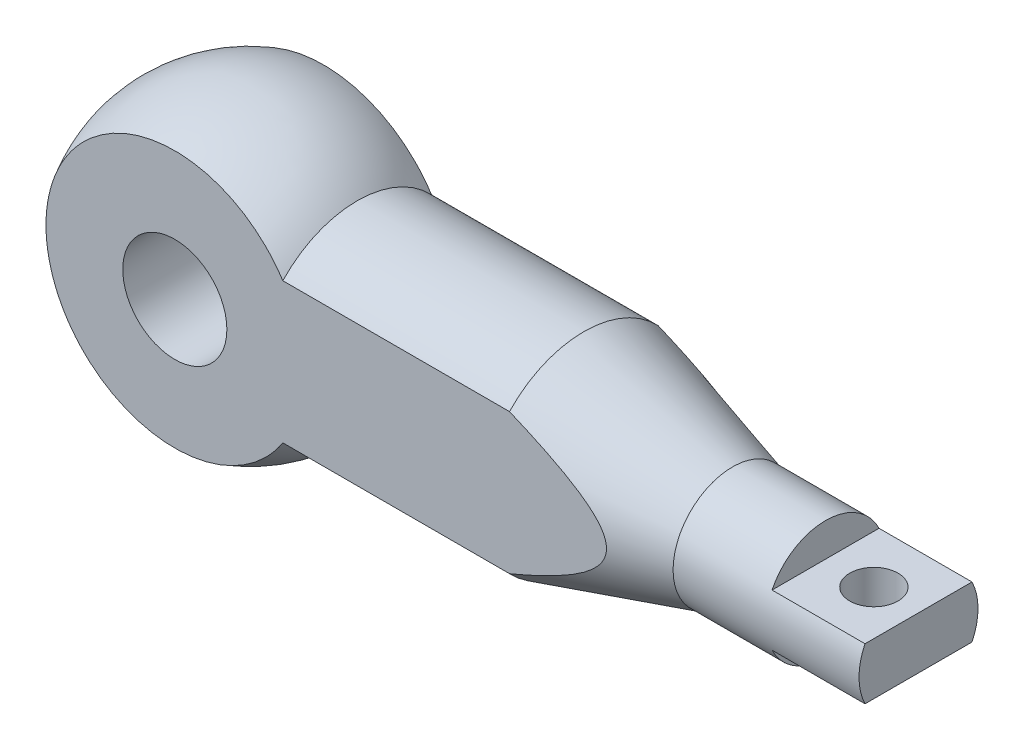
ISO-10303-21;
HEADER;
FILE_DESCRIPTION(('STEP AP214'),'2;1');
FILE_NAME('part.step','',(''),(''),'','','');
FILE_SCHEMA(('AUTOMOTIVE_DESIGN { 1 0 10303 214 1 1 1 1 }'));
ENDSEC;
DATA;
#1=APPLICATION_CONTEXT('core data for automotive mechanical design processes');
#2=APPLICATION_PROTOCOL_DEFINITION('international standard','automotive_design',2000,#1);
#3=PRODUCT_CONTEXT('',#1,'mechanical');
#4=PRODUCT('Part','Part','',(#3));
#5=PRODUCT_RELATED_PRODUCT_CATEGORY('part','',(#4));
#6=PRODUCT_DEFINITION_FORMATION('','',#4);
#7=PRODUCT_DEFINITION_CONTEXT('part definition',#1,'design');
#8=PRODUCT_DEFINITION('design','',#6,#7);
#9=PRODUCT_DEFINITION_SHAPE('','',#8);
#10=(LENGTH_UNIT() NAMED_UNIT(*) SI_UNIT(.MILLI.,.METRE.));
#11=(NAMED_UNIT(*) PLANE_ANGLE_UNIT() SI_UNIT($,.RADIAN.));
#12=(NAMED_UNIT(*) SI_UNIT($,.STERADIAN.) SOLID_ANGLE_UNIT());
#13=UNCERTAINTY_MEASURE_WITH_UNIT(LENGTH_MEASURE(1.E-05),#10,'distance_accuracy_value','');
#14=(GEOMETRIC_REPRESENTATION_CONTEXT(3) GLOBAL_UNCERTAINTY_ASSIGNED_CONTEXT((#13)) GLOBAL_UNIT_ASSIGNED_CONTEXT((#10,
#11,#12)) REPRESENTATION_CONTEXT('',''));
#15=CARTESIAN_POINT('',(0.,0.,0.));
#16=DIRECTION('',(0.,0.,1.));
#17=DIRECTION('',(1.,0.,0.));
#18=AXIS2_PLACEMENT_3D('',#15,#16,#17);
#19=CARTESIAN_POINT('',(0.,0.,0.));
#20=DIRECTION('',(-1.,0.,0.));
#21=DIRECTION('',(0.,1.,0.));
#22=AXIS2_PLACEMENT_3D('',#19,#20,#21);
#23=SPHERICAL_SURFACE('',#22,40.);
#24=CARTESIAN_POINT('',(-40.,0.,0.));
#25=VERTEX_POINT('',#24);
#26=VERTEX_LOOP('',#25);
#27=FACE_BOUND('',#26,.T.);
#28=CARTESIAN_POINT('',(0.,0.,-20.));
#29=DIRECTION('',(0.,0.,-1.));
#30=DIRECTION('',(-1.,0.,0.));
#31=AXIS2_PLACEMENT_3D('',#28,#29,#30);
#32=CIRCLE('',#31,34.6410161513775);
#33=CARTESIAN_POINT('',(29.0473750965556,-18.8745860881769,-20.));
#34=VERTEX_POINT('',#33);
#35=CARTESIAN_POINT('',(29.0473750965556,18.8745860881769,-20.));
#36=VERTEX_POINT('',#35);
#37=EDGE_CURVE('E191',#34,#36,#32,.T.);
#38=ORIENTED_EDGE('',*,*,#37,.F.);
#39=CARTESIAN_POINT('',(29.0473750965556,0.,0.));
#40=DIRECTION('',(-1.,0.,0.));
#41=DIRECTION('',(0.,0.,1.));
#42=AXIS2_PLACEMENT_3D('',#39,#40,#41);
#43=CIRCLE('',#42,27.5);
#44=CARTESIAN_POINT('',(29.0473750965556,-18.8745860881769,20.));
#45=VERTEX_POINT('',#44);
#46=EDGE_CURVE('E194',#34,#45,#43,.T.);
#47=ORIENTED_EDGE('',*,*,#46,.T.);
#48=CARTESIAN_POINT('',(0.,0.,20.));
#49=DIRECTION('',(0.,0.,1.));
#50=DIRECTION('',(1.,0.,0.));
#51=AXIS2_PLACEMENT_3D('',#48,#49,#50);
#52=CIRCLE('',#51,34.6410161513775);
#53=CARTESIAN_POINT('',(29.0473750965556,18.8745860881769,20.));
#54=VERTEX_POINT('',#53);
#55=EDGE_CURVE('E157',#54,#45,#52,.T.);
#56=ORIENTED_EDGE('',*,*,#55,.F.);
#57=EDGE_CURVE('E196',#54,#36,#43,.T.);
#58=ORIENTED_EDGE('',*,*,#57,.T.);
#59=EDGE_LOOP('',(#38,#47,#56,#58));
#60=FACE_BOUND('',#59,.T.);
#61=ADVANCED_FACE('F34',(#27,#60),#23,.T.);
#62=CARTESIAN_POINT('',(130.,0.,0.));
#63=DIRECTION('',(-1.,0.,0.));
#64=DIRECTION('',(0.,0.,1.));
#65=AXIS2_PLACEMENT_3D('',#62,#63,#64);
#66=CONICAL_SURFACE('',#65,16.,0.279949822523791);
#67=CARTESIAN_POINT('',(130.,0.,0.));
#68=DIRECTION('',(-1.,0.,0.));
#69=DIRECTION('',(0.,0.,1.));
#70=AXIS2_PLACEMENT_3D('',#67,#68,#69);
#71=CIRCLE('',#70,16.);
#72=CARTESIAN_POINT('',(130.,0.,16.));
#73=VERTEX_POINT('',#72);
#74=EDGE_CURVE('E127',#73,#73,#71,.T.);
#75=ORIENTED_EDGE('',*,*,#74,.T.);
#76=EDGE_LOOP('',(#75));
#77=FACE_BOUND('',#76,.T.);
#78=CARTESIAN_POINT('',(21.9924474563228,42.5899850826846,-20.));
#79=CARTESIAN_POINT('',(23.437598565439,42.1309670722524,-20.));
#80=CARTESIAN_POINT('',(24.8823671394123,41.6707431873531,-20.));
#81=CARTESIAN_POINT('',(27.7710477124205,40.7476090602787,-20.));
#82=CARTESIAN_POINT('',(29.2149597103785,40.2846988147343,-20.));
#83=CARTESIAN_POINT('',(32.1018917137608,39.3558992970046,-20.));
#84=CARTESIAN_POINT('',(33.5449116798131,38.8900099023724,-20.));
#85=CARTESIAN_POINT('',(36.4298833165273,37.9549386823622,-20.));
#86=CARTESIAN_POINT('',(37.87183498751,37.4857568579736,-20.));
#87=CARTESIAN_POINT('',(42.2011960890287,36.0710053928918,-20.));
#88=CARTESIAN_POINT('',(45.0868128174878,35.1199316189122,-20.));
#89=CARTESIAN_POINT('',(49.4105737590026,33.6794467201712,-20.));
#90=CARTESIAN_POINT('',(50.8510327256641,33.1969786090895,-20.));
#91=CARTESIAN_POINT('',(53.7301751026933,32.2267752886057,-20.));
#92=CARTESIAN_POINT('',(55.1688585153271,31.7390400859335,-20.));
#93=CARTESIAN_POINT('',(58.0804434026692,30.7451872230975,-20.));
#94=CARTESIAN_POINT('',(59.5532925659845,30.2389162160143,-20.));
#95=CARTESIAN_POINT('',(62.4964719911645,29.2190931417289,-20.));
#96=CARTESIAN_POINT('',(63.9668022499486,28.7055410656292,-20.));
#97=CARTESIAN_POINT('',(66.9045984335502,27.6699205399513,-20.));
#98=CARTESIAN_POINT('',(68.3720641146143,27.1478513982224,-20.));
#99=CARTESIAN_POINT('',(71.3034102782338,26.0937465586937,-20.));
#100=CARTESIAN_POINT('',(72.7672907724239,25.5617108932863,-20.));
#101=CARTESIAN_POINT('',(75.6893484761253,24.4862700602522,-20.));
#102=CARTESIAN_POINT('',(77.147529692395,23.9428757978173,-20.));
#103=CARTESIAN_POINT('',(80.0585136392933,22.8417811912516,-20.));
#104=CARTESIAN_POINT('',(81.5113162885724,22.2840806317454,-20.));
#105=CARTESIAN_POINT('',(84.4098824393558,21.1512230289159,-20.));
#106=CARTESIAN_POINT('',(85.8556469408269,20.5760685547029,-20.));
#107=CARTESIAN_POINT('',(88.0175508550531,19.6968289139009,-20.));
#108=CARTESIAN_POINT('',(88.7370514479019,19.4010020596576,-20.));
#109=CARTESIAN_POINT('',(90.1734500985106,18.8031011510316,-20.));
#110=CARTESIAN_POINT('',(90.89034817465,18.5010271408689,-20.));
#111=CARTESIAN_POINT('',(92.3140951756241,17.8927667836035,-20.));
#112=CARTESIAN_POINT('',(93.0209737060989,17.5866498115857,-20.));
#113=CARTESIAN_POINT('',(94.431227779038,16.966417611519,-20.));
#114=CARTESIAN_POINT('',(95.1346032825116,16.6523022946809,-20.));
#115=CARTESIAN_POINT('',(96.5375362696747,16.0146470343511,-20.));
#116=CARTESIAN_POINT('',(97.237091481773,15.6911020837192,-20.));
#117=CARTESIAN_POINT('',(98.6310871321337,15.0331817991782,-20.));
#118=CARTESIAN_POINT('',(99.325527655724,14.6988066464533,-20.));
#119=CARTESIAN_POINT('',(100.708231867491,14.0171569767832,-20.));
#120=CARTESIAN_POINT('',(101.396494366146,13.669880039173,-20.));
#121=CARTESIAN_POINT('',(102.765002594711,12.9599069237916,-20.));
#122=CARTESIAN_POINT('',(103.445248686736,12.5972114459413,-20.));
#123=CARTESIAN_POINT('',(104.794873783464,11.8532457951904,-20.));
#124=CARTESIAN_POINT('',(105.464261091526,11.4719908024451,-20.));
#125=CARTESIAN_POINT('',(106.457808155807,10.8824869368944,-20.));
#126=CARTESIAN_POINT('',(106.78720998419,10.6830647335009,-20.));
#127=CARTESIAN_POINT('',(107.441883869839,10.2775535933372,-20.));
#128=CARTESIAN_POINT('',(107.767155982562,10.0714647462238,-20.));
#129=CARTESIAN_POINT('',(108.589144644756,9.53710795480112,-20.));
#130=CARTESIAN_POINT('',(109.082468843452,9.20358662893558,-20.));
#131=CARTESIAN_POINT('',(110.053781472178,8.51409397845443,-20.));
#132=CARTESIAN_POINT('',(110.53176116356,8.15811019211158,-20.));
#133=CARTESIAN_POINT('',(111.230919586959,7.60412835384962,-20.));
#134=CARTESIAN_POINT('',(111.460436007833,7.41664126499594,-20.));
#135=CARTESIAN_POINT('',(111.912834551448,7.03384702494277,-20.));
#136=CARTESIAN_POINT('',(112.13571749249,6.83854084532803,-20.));
#137=CARTESIAN_POINT('',(112.573227494862,6.43927323305803,-20.));
#138=CARTESIAN_POINT('',(112.787862282269,6.23532029617721,-20.));
#139=CARTESIAN_POINT('',(113.207178401096,5.81746995845122,-20.));
#140=CARTESIAN_POINT('',(113.41186244904,5.6035753032122,-20.));
#141=CARTESIAN_POINT('',(113.756668340188,5.22221677207065,-20.));
#142=CARTESIAN_POINT('',(113.899624008523,5.05731845008054,-20.));
#143=CARTESIAN_POINT('',(114.177514319685,4.72087590520223,-20.));
#144=CARTESIAN_POINT('',(114.312449038002,4.54933174488697,-20.));
#145=CARTESIAN_POINT('',(114.572952080916,4.19879060158653,-20.));
#146=CARTESIAN_POINT('',(114.698505678262,4.01978256012932,-20.));
#147=CARTESIAN_POINT('',(114.938089651215,3.65422857229796,-20.));
#148=CARTESIAN_POINT('',(115.052116826172,3.46768055224774,-20.));
#149=CARTESIAN_POINT('',(115.376726411668,2.89040321693895,-20.));
#150=CARTESIAN_POINT('',(115.566089782883,2.48688492027374,-20.));
#151=CARTESIAN_POINT('',(115.790147675462,1.86108557204992,-20.));
#152=CARTESIAN_POINT('',(115.854795192861,1.64932440516158,-20.));
#153=CARTESIAN_POINT('',(115.961582216662,1.22015042559888,-20.));
#154=CARTESIAN_POINT('',(116.003731799472,1.00274018887061,-20.));
#155=CARTESIAN_POINT('',(116.056062294314,0.618579885846377,-20.));
#156=CARTESIAN_POINT('',(116.071559576141,0.452538284389132,-20.));
#157=CARTESIAN_POINT('',(116.088117529,0.119688355108796,-20.));
#158=CARTESIAN_POINT('',(116.089175629404,-0.0471201039512307,-20.));
#159=CARTESIAN_POINT('',(116.076797982119,-0.380211333940618,-20.));
#160=CARTESIAN_POINT('',(116.063361014967,-0.54649405945982,-20.));
#161=CARTESIAN_POINT('',(116.022435749169,-0.877344504882928,-20.));
#162=CARTESIAN_POINT('',(115.994942074696,-1.04191154405454,-20.));
#163=CARTESIAN_POINT('',(115.892924925976,-1.52933520486074,-20.));
#164=CARTESIAN_POINT('',(115.798761904273,-1.84821398736369,-20.));
#165=CARTESIAN_POINT('',(115.566993548098,-2.46937903959007,-20.));
#166=CARTESIAN_POINT('',(115.429363402852,-2.77165571696688,-20.));
#167=CARTESIAN_POINT('',(115.1322768738,-3.33552293276714,-20.));
#168=CARTESIAN_POINT('',(114.975318836611,-3.59845387094868,-20.));
#169=CARTESIAN_POINT('',(114.638898354289,-4.10963097911261,-20.));
#170=CARTESIAN_POINT('',(114.459417435436,-4.35786484540823,-20.));
#171=CARTESIAN_POINT('',(114.082431080516,-4.84147628273031,-20.));
#172=CARTESIAN_POINT('',(113.884866240249,-5.07680710338389,-20.));
#173=CARTESIAN_POINT('',(113.476112614994,-5.53508074116527,-20.));
#174=CARTESIAN_POINT('',(113.264928295712,-5.75802757471178,-20.));
#175=CARTESIAN_POINT('',(112.718452185801,-6.30687602493041,-20.));
#176=CARTESIAN_POINT('',(112.376013251545,-6.62564591349044,-20.));
#177=CARTESIAN_POINT('',(111.672989025194,-7.24264279229501,-20.));
#178=CARTESIAN_POINT('',(111.312393272159,-7.54085770003576,-20.));
#179=CARTESIAN_POINT('',(110.577006829918,-8.12076574959707,-20.));
#180=CARTESIAN_POINT('',(110.202188121366,-8.40242316043324,-20.));
#181=CARTESIAN_POINT('',(109.442314474208,-8.95131778562624,-20.));
#182=CARTESIAN_POINT('',(109.057261674661,-9.21855797853731,-20.));
#183=CARTESIAN_POINT('',(108.276690473349,-9.7425081476272,-20.));
#184=CARTESIAN_POINT('',(107.881122701684,-9.99914428535307,-20.));
#185=CARTESIAN_POINT('',(107.083400294856,-10.5019703878212,-20.));
#186=CARTESIAN_POINT('',(106.681245369657,-10.7481598908689,-20.));
#187=CARTESIAN_POINT('',(105.872111734664,-11.2312088547511,-20.));
#188=CARTESIAN_POINT('',(105.465140173241,-11.4680803204936,-20.));
#189=CARTESIAN_POINT('',(104.646773819577,-11.9340008662693,-20.));
#190=CARTESIAN_POINT('',(104.235379190512,-12.163050233582,-20.));
#191=CARTESIAN_POINT('',(103.347121332171,-12.6480089281122,-20.));
#192=CARTESIAN_POINT('',(102.869658730326,-12.9028192768526,-20.));
#193=CARTESIAN_POINT('',(101.910620223398,-13.404589544178,-20.));
#194=CARTESIAN_POINT('',(101.429044198967,-13.6515492339978,-20.));
#195=CARTESIAN_POINT('',(99.979031338618,-14.3822157211908,-20.));
#196=CARTESIAN_POINT('',(99.0054149170414,-14.8556531336986,-20.));
#197=CARTESIAN_POINT('',(97.0475895255269,-15.7813206575308,-20.));
#198=CARTESIAN_POINT('',(96.0633751885499,-16.2335393358541,-20.));
#199=CARTESIAN_POINT('',(94.0872615341414,-17.1206603333562,-20.));
#200=CARTESIAN_POINT('',(93.0953626744555,-17.5555636746302,-20.));
#201=CARTESIAN_POINT('',(91.1033763169065,-18.4120892976507,-20.));
#202=CARTESIAN_POINT('',(90.1032759302894,-18.8336815188823,-20.));
#203=CARTESIAN_POINT('',(88.0981443176557,-19.6649868798601,-20.));
#204=CARTESIAN_POINT('',(87.0931130280065,-20.0746998658319,-20.));
#205=CARTESIAN_POINT('',(85.0793148327839,-20.8839547820771,-20.));
#206=CARTESIAN_POINT('',(84.0705491170653,-21.2834996780402,-20.));
#207=CARTESIAN_POINT('',(82.0496633939139,-22.0739896632614,-20.));
#208=CARTESIAN_POINT('',(81.0375434017231,-22.4649347915354,-20.));
#209=CARTESIAN_POINT('',(79.012264454597,-23.2387067982918,-20.));
#210=CARTESIAN_POINT('',(77.9991105256221,-23.6215468447572,-20.));
#211=CARTESIAN_POINT('',(75.9703848989818,-24.3807606163451,-20.));
#212=CARTESIAN_POINT('',(74.9548131998697,-24.7571343375972,-20.));
#213=CARTESIAN_POINT('',(71.9048466853425,-25.8778127011658,-20.));
#214=CARTESIAN_POINT('',(69.8673299561755,-26.6136253149001,-20.));
#215=CARTESIAN_POINT('',(65.7881717182383,-28.0666532593318,-20.));
#216=CARTESIAN_POINT('',(63.7465370234388,-28.7838877822105,-20.));
#217=CARTESIAN_POINT('',(59.6582779313159,-30.2040087156195,-20.));
#218=CARTESIAN_POINT('',(57.6116535080081,-30.9068950512507,-20.));
#219=CARTESIAN_POINT('',(52.7737984098444,-32.5529030405204,-20.));
#220=CARTESIAN_POINT('',(49.9808630310248,-33.4910102655995,-20.));
#221=CARTESIAN_POINT('',(44.3885327153322,-35.3504969071541,-20.));
#222=CARTESIAN_POINT('',(41.5891361260322,-36.2718713434682,-20.));
#223=CARTESIAN_POINT('',(35.9917622131901,-38.0990979531785,-20.));
#224=CARTESIAN_POINT('',(33.1937941625515,-39.0049785560708,-20.));
#225=CARTESIAN_POINT('',(28.9946159512308,-40.3553756262668,-20.));
#226=CARTESIAN_POINT('',(27.5947358268864,-40.804035179601,-20.));
#227=CARTESIAN_POINT('',(24.7941733435724,-41.6988370808564,-20.));
#228=CARTESIAN_POINT('',(23.3934909857041,-42.1449794322236,-20.));
#229=CARTESIAN_POINT('',(21.9924474563228,-42.5899850826846,-20.));
#230=B_SPLINE_CURVE_WITH_KNOTS('',3,(#78,#79,#80,#81,#82,#83,#84,#85,#86,#87,#88,#89,#90,#91,
#92,#93,#94,#95,#96,#97,#98,#99,#100,#101,#102,#103,#104,#105,#106,#107,#108,#109,#110,#111,
#112,#113,#114,#115,#116,#117,#118,#119,#120,#121,#122,#123,#124,#125,#126,#127,#128,#129,#130,
#131,#132,#133,#134,#135,#136,#137,#138,#139,#140,#141,#142,#143,#144,#145,#146,#147,#148,#149,
#150,#151,#152,#153,#154,#155,#156,#157,#158,#159,#160,#161,#162,#163,#164,#165,#166,#167,#168,
#169,#170,#171,#172,#173,#174,#175,#176,#177,#178,#179,#180,#181,#182,#183,#184,#185,#186,#187,
#188,#189,#190,#191,#192,#193,#194,#195,#196,#197,#198,#199,#200,#201,#202,#203,#204,#205,#206,
#207,#208,#209,#210,#211,#212,#213,#214,#215,#216,#217,#218,#219,#220,#221,#222,#223,#224,#225,
#226,#227,#228,#229),.UNSPECIFIED.,.F.,.F.,(4,2,2,2,2,2,2,2,2,2,2,2,2,2,2,2,2,2,2,2,2,2,2,2,2,2,
2,2,2,2,2,2,2,2,2,2,2,2,2,2,2,2,2,2,2,2,2,2,2,2,2,2,2,2,2,2,2,2,2,2,2,2,2,2,2,2,2,2,2,2,2,2,2,2,
2,4),(0.,4.54889373494706,9.09779317660497,13.6468808016157,18.1959670597879,27.3108355824477,
31.8681600607925,36.4254787166028,41.0977589254969,45.7700448443672,50.4427123731248,
55.1153647178696,59.7837201392481,64.4521458821113,69.1198877626353,71.4536919684799,
73.7874796603175,76.0983815821933,78.4093091685197,80.7214870564222,83.0336262826372,
85.3462015310274,87.658671912513,89.9692816618092,91.1244092432065,92.2795212962417,
94.0655268343915,95.8525320761455,96.741471806987,97.6303014206966,98.5182770948432,
99.4060089770293,100.060509822305,100.715004506719,101.370505974913,102.026188965157,
103.355798629233,104.019057873323,104.682019806108,105.181727611204,105.68152437877,
106.181363197279,106.681393316581,107.674633395988,108.668441438698,109.58568660115,
110.503689085154,111.424823466708,112.345657337134,113.748049532466,115.151259164717,
116.557393438144,117.963236087096,119.377619711769,120.792065780913,122.204625510705,
123.617133306018,125.240649115135,126.86421218957,130.111696864842,133.360911703256,
136.609934460763,139.865834413358,143.121776494093,146.376757782167,149.631724299796,
152.880918178942,156.130114002854,162.628921258318,169.120723034053,175.61255868909,
184.451307480933,193.29264519639,202.115494953103,206.52555409034,210.935607188957),.UNSPECIFIED.);
#231=CARTESIAN_POINT('',(90.,18.8745860881769,-20.));
#232=VERTEX_POINT('',#231);
#233=CARTESIAN_POINT('',(90.,-18.8745860881769,-20.));
#234=VERTEX_POINT('',#233);
#235=EDGE_CURVE('E199',#232,#234,#230,.T.);
#236=ORIENTED_EDGE('',*,*,#235,.F.);
#237=CARTESIAN_POINT('',(90.,0.,0.));
#238=DIRECTION('',(-1.,0.,0.));
#239=DIRECTION('',(0.,0.,1.));
#240=AXIS2_PLACEMENT_3D('',#237,#238,#239);
#241=CIRCLE('',#240,27.5);
#242=CARTESIAN_POINT('',(90.,18.8745860881769,20.));
#243=VERTEX_POINT('',#242);
#244=EDGE_CURVE('E206',#243,#232,#241,.T.);
#245=ORIENTED_EDGE('',*,*,#244,.F.);
#246=CARTESIAN_POINT('',(21.9924474563228,-42.5899850826846,20.));
#247=CARTESIAN_POINT('',(23.437598565439,-42.1309670722524,20.));
#248=CARTESIAN_POINT('',(24.8823671394123,-41.6707431873531,20.));
#249=CARTESIAN_POINT('',(27.7710477124205,-40.7476090602787,20.));
#250=CARTESIAN_POINT('',(29.2149597103785,-40.2846988147343,20.));
#251=CARTESIAN_POINT('',(32.1018917137608,-39.3558992970046,20.));
#252=CARTESIAN_POINT('',(33.5449116798131,-38.8900099023724,20.));
#253=CARTESIAN_POINT('',(36.4298833165273,-37.9549386823622,20.));
#254=CARTESIAN_POINT('',(37.87183498751,-37.4857568579736,20.));
#255=CARTESIAN_POINT('',(42.2011960890287,-36.0710053928918,20.));
#256=CARTESIAN_POINT('',(45.0868128174878,-35.1199316189122,20.));
#257=CARTESIAN_POINT('',(49.4105737590026,-33.6794467201712,20.));
#258=CARTESIAN_POINT('',(50.8510327256641,-33.1969786090895,20.));
#259=CARTESIAN_POINT('',(53.7301751026933,-32.2267752886057,20.));
#260=CARTESIAN_POINT('',(55.1688585153271,-31.7390400859335,20.));
#261=CARTESIAN_POINT('',(58.0804434026692,-30.7451872230975,20.));
#262=CARTESIAN_POINT('',(59.5532925659845,-30.2389162160143,20.));
#263=CARTESIAN_POINT('',(62.4964719911645,-29.2190931417289,20.));
#264=CARTESIAN_POINT('',(63.9668022499486,-28.7055410656292,20.));
#265=CARTESIAN_POINT('',(66.9045984335502,-27.6699205399513,20.));
#266=CARTESIAN_POINT('',(68.3720641146143,-27.1478513982224,20.));
#267=CARTESIAN_POINT('',(71.3034102782338,-26.0937465586937,20.));
#268=CARTESIAN_POINT('',(72.7672907724239,-25.5617108932863,20.));
#269=CARTESIAN_POINT('',(75.6893484761253,-24.4862700602522,20.));
#270=CARTESIAN_POINT('',(77.147529692395,-23.9428757978173,20.));
#271=CARTESIAN_POINT('',(80.0585136392933,-22.8417811912516,20.));
#272=CARTESIAN_POINT('',(81.5113162885724,-22.2840806317454,20.));
#273=CARTESIAN_POINT('',(84.4098824393558,-21.1512230289159,20.));
#274=CARTESIAN_POINT('',(85.8556469408269,-20.5760685547029,20.));
#275=CARTESIAN_POINT('',(88.0175508550531,-19.6968289139009,20.));
#276=CARTESIAN_POINT('',(88.7370514479019,-19.4010020596576,20.));
#277=CARTESIAN_POINT('',(90.1734500985106,-18.8031011510316,20.));
#278=CARTESIAN_POINT('',(90.89034817465,-18.5010271408689,20.));
#279=CARTESIAN_POINT('',(92.3140951756241,-17.8927667836035,20.));
#280=CARTESIAN_POINT('',(93.0209737060989,-17.5866498115857,20.));
#281=CARTESIAN_POINT('',(94.431227779038,-16.966417611519,20.));
#282=CARTESIAN_POINT('',(95.1346032825116,-16.6523022946809,20.));
#283=CARTESIAN_POINT('',(96.5375362696747,-16.0146470343511,20.));
#284=CARTESIAN_POINT('',(97.237091481773,-15.6911020837192,20.));
#285=CARTESIAN_POINT('',(98.6310871321337,-15.0331817991782,20.));
#286=CARTESIAN_POINT('',(99.325527655724,-14.6988066464533,20.));
#287=CARTESIAN_POINT('',(100.708231867491,-14.0171569767832,20.));
#288=CARTESIAN_POINT('',(101.396494366146,-13.669880039173,20.));
#289=CARTESIAN_POINT('',(102.765002594711,-12.9599069237916,20.));
#290=CARTESIAN_POINT('',(103.445248686736,-12.5972114459413,20.));
#291=CARTESIAN_POINT('',(104.794873783464,-11.8532457951904,20.));
#292=CARTESIAN_POINT('',(105.464261091526,-11.4719908024451,20.));
#293=CARTESIAN_POINT('',(106.457808155807,-10.8824869368944,20.));
#294=CARTESIAN_POINT('',(106.78720998419,-10.6830647335009,20.));
#295=CARTESIAN_POINT('',(107.441883869839,-10.2775535933372,20.));
#296=CARTESIAN_POINT('',(107.767155982562,-10.0714647462238,20.));
#297=CARTESIAN_POINT('',(108.589144644756,-9.53710795480112,20.));
#298=CARTESIAN_POINT('',(109.082468843452,-9.20358662893558,20.));
#299=CARTESIAN_POINT('',(110.053781472178,-8.51409397845443,20.));
#300=CARTESIAN_POINT('',(110.53176116356,-8.15811019211158,20.));
#301=CARTESIAN_POINT('',(111.230919586959,-7.60412835384962,20.));
#302=CARTESIAN_POINT('',(111.460436007833,-7.41664126499594,20.));
#303=CARTESIAN_POINT('',(111.912834551448,-7.03384702494277,20.));
#304=CARTESIAN_POINT('',(112.13571749249,-6.83854084532803,20.));
#305=CARTESIAN_POINT('',(112.573227494862,-6.43927323305803,20.));
#306=CARTESIAN_POINT('',(112.787862282269,-6.23532029617721,20.));
#307=CARTESIAN_POINT('',(113.207178401096,-5.81746995845122,20.));
#308=CARTESIAN_POINT('',(113.41186244904,-5.6035753032122,20.));
#309=CARTESIAN_POINT('',(113.756668340188,-5.22221677207065,20.));
#310=CARTESIAN_POINT('',(113.899624008523,-5.05731845008054,20.));
#311=CARTESIAN_POINT('',(114.177514319685,-4.72087590520223,20.));
#312=CARTESIAN_POINT('',(114.312449038002,-4.54933174488697,20.));
#313=CARTESIAN_POINT('',(114.572952080916,-4.19879060158653,20.));
#314=CARTESIAN_POINT('',(114.698505678262,-4.01978256012932,20.));
#315=CARTESIAN_POINT('',(114.938089651215,-3.65422857229796,20.));
#316=CARTESIAN_POINT('',(115.052116826172,-3.46768055224774,20.));
#317=CARTESIAN_POINT('',(115.376726411668,-2.89040321693895,20.));
#318=CARTESIAN_POINT('',(115.566089782883,-2.48688492027374,20.));
#319=CARTESIAN_POINT('',(115.790147675462,-1.86108557204992,20.));
#320=CARTESIAN_POINT('',(115.854795192861,-1.64932440516158,20.));
#321=CARTESIAN_POINT('',(115.961582216662,-1.22015042559888,20.));
#322=CARTESIAN_POINT('',(116.003731799472,-1.00274018887061,20.));
#323=CARTESIAN_POINT('',(116.056062294314,-0.618579885846377,20.));
#324=CARTESIAN_POINT('',(116.071559576141,-0.452538284389132,20.));
#325=CARTESIAN_POINT('',(116.088117529,-0.119688355108796,20.));
#326=CARTESIAN_POINT('',(116.089175629404,0.0471201039512307,20.));
#327=CARTESIAN_POINT('',(116.076797982119,0.380211333940618,20.));
#328=CARTESIAN_POINT('',(116.063361014967,0.54649405945982,20.));
#329=CARTESIAN_POINT('',(116.022435749169,0.877344504882928,20.));
#330=CARTESIAN_POINT('',(115.994942074696,1.04191154405454,20.));
#331=CARTESIAN_POINT('',(115.892924925976,1.52933520486074,20.));
#332=CARTESIAN_POINT('',(115.798761904273,1.84821398736369,20.));
#333=CARTESIAN_POINT('',(115.566993548098,2.46937903959007,20.));
#334=CARTESIAN_POINT('',(115.429363402852,2.77165571696688,20.));
#335=CARTESIAN_POINT('',(115.1322768738,3.33552293276714,20.));
#336=CARTESIAN_POINT('',(114.975318836611,3.59845387094868,20.));
#337=CARTESIAN_POINT('',(114.638898354289,4.10963097911261,20.));
#338=CARTESIAN_POINT('',(114.459417435436,4.35786484540823,20.));
#339=CARTESIAN_POINT('',(114.082431080516,4.84147628273031,20.));
#340=CARTESIAN_POINT('',(113.884866240249,5.07680710338389,20.));
#341=CARTESIAN_POINT('',(113.476112614994,5.53508074116527,20.));
#342=CARTESIAN_POINT('',(113.264928295712,5.75802757471178,20.));
#343=CARTESIAN_POINT('',(112.718452185801,6.30687602493041,20.));
#344=CARTESIAN_POINT('',(112.376013251545,6.62564591349044,20.));
#345=CARTESIAN_POINT('',(111.672989025194,7.24264279229501,20.));
#346=CARTESIAN_POINT('',(111.312393272159,7.54085770003576,20.));
#347=CARTESIAN_POINT('',(110.577006829918,8.12076574959707,20.));
#348=CARTESIAN_POINT('',(110.202188121366,8.40242316043324,20.));
#349=CARTESIAN_POINT('',(109.442314474208,8.95131778562624,20.));
#350=CARTESIAN_POINT('',(109.057261674661,9.21855797853731,20.));
#351=CARTESIAN_POINT('',(108.276690473349,9.7425081476272,20.));
#352=CARTESIAN_POINT('',(107.881122701684,9.99914428535307,20.));
#353=CARTESIAN_POINT('',(107.083400294856,10.5019703878212,20.));
#354=CARTESIAN_POINT('',(106.681245369657,10.7481598908689,20.));
#355=CARTESIAN_POINT('',(105.872111734664,11.2312088547511,20.));
#356=CARTESIAN_POINT('',(105.465140173241,11.4680803204936,20.));
#357=CARTESIAN_POINT('',(104.646773819577,11.9340008662693,20.));
#358=CARTESIAN_POINT('',(104.235379190512,12.163050233582,20.));
#359=CARTESIAN_POINT('',(103.347121332171,12.6480089281122,20.));
#360=CARTESIAN_POINT('',(102.869658730326,12.9028192768526,20.));
#361=CARTESIAN_POINT('',(101.910620223398,13.404589544178,20.));
#362=CARTESIAN_POINT('',(101.429044198967,13.6515492339978,20.));
#363=CARTESIAN_POINT('',(99.979031338618,14.3822157211908,20.));
#364=CARTESIAN_POINT('',(99.0054149170414,14.8556531336986,20.));
#365=CARTESIAN_POINT('',(97.0475895255269,15.7813206575308,20.));
#366=CARTESIAN_POINT('',(96.0633751885499,16.2335393358541,20.));
#367=CARTESIAN_POINT('',(94.0872615341414,17.1206603333562,20.));
#368=CARTESIAN_POINT('',(93.0953626744555,17.5555636746302,20.));
#369=CARTESIAN_POINT('',(91.1033763169065,18.4120892976507,20.));
#370=CARTESIAN_POINT('',(90.1032759302894,18.8336815188823,20.));
#371=CARTESIAN_POINT('',(88.0981443176557,19.6649868798601,20.));
#372=CARTESIAN_POINT('',(87.0931130280065,20.0746998658319,20.));
#373=CARTESIAN_POINT('',(85.0793148327839,20.8839547820771,20.));
#374=CARTESIAN_POINT('',(84.0705491170653,21.2834996780402,20.));
#375=CARTESIAN_POINT('',(82.0496633939139,22.0739896632614,20.));
#376=CARTESIAN_POINT('',(81.0375434017231,22.4649347915354,20.));
#377=CARTESIAN_POINT('',(79.012264454597,23.2387067982918,20.));
#378=CARTESIAN_POINT('',(77.9991105256221,23.6215468447572,20.));
#379=CARTESIAN_POINT('',(75.9703848989818,24.3807606163451,20.));
#380=CARTESIAN_POINT('',(74.9548131998697,24.7571343375972,20.));
#381=CARTESIAN_POINT('',(71.9048466853425,25.8778127011658,20.));
#382=CARTESIAN_POINT('',(69.8673299561755,26.6136253149001,20.));
#383=CARTESIAN_POINT('',(65.7881717182383,28.0666532593318,20.));
#384=CARTESIAN_POINT('',(63.7465370234388,28.7838877822105,20.));
#385=CARTESIAN_POINT('',(59.6582779313159,30.2040087156195,20.));
#386=CARTESIAN_POINT('',(57.6116535080081,30.9068950512507,20.));
#387=CARTESIAN_POINT('',(52.7737984098444,32.5529030405204,20.));
#388=CARTESIAN_POINT('',(49.9808630310248,33.4910102655995,20.));
#389=CARTESIAN_POINT('',(44.3885327153322,35.3504969071541,20.));
#390=CARTESIAN_POINT('',(41.5891361260322,36.2718713434682,20.));
#391=CARTESIAN_POINT('',(35.9917622131901,38.0990979531785,20.));
#392=CARTESIAN_POINT('',(33.1937941625515,39.0049785560708,20.));
#393=CARTESIAN_POINT('',(28.9946159512308,40.3553756262668,20.));
#394=CARTESIAN_POINT('',(27.5947358268864,40.804035179601,20.));
#395=CARTESIAN_POINT('',(24.7941733435724,41.6988370808564,20.));
#396=CARTESIAN_POINT('',(23.3934909857041,42.1449794322236,20.));
#397=CARTESIAN_POINT('',(21.9924474563228,42.5899850826846,20.));
#398=B_SPLINE_CURVE_WITH_KNOTS('',3,(#246,#247,#248,#249,#250,#251,#252,#253,#254,#255,#256,
#257,#258,#259,#260,#261,#262,#263,#264,#265,#266,#267,#268,#269,#270,#271,#272,#273,#274,#275,
#276,#277,#278,#279,#280,#281,#282,#283,#284,#285,#286,#287,#288,#289,#290,#291,#292,#293,#294,
#295,#296,#297,#298,#299,#300,#301,#302,#303,#304,#305,#306,#307,#308,#309,#310,#311,#312,#313,
#314,#315,#316,#317,#318,#319,#320,#321,#322,#323,#324,#325,#326,#327,#328,#329,#330,#331,#332,
#333,#334,#335,#336,#337,#338,#339,#340,#341,#342,#343,#344,#345,#346,#347,#348,#349,#350,#351,
#352,#353,#354,#355,#356,#357,#358,#359,#360,#361,#362,#363,#364,#365,#366,#367,#368,#369,#370,
#371,#372,#373,#374,#375,#376,#377,#378,#379,#380,#381,#382,#383,#384,#385,#386,#387,#388,#389,
#390,#391,#392,#393,#394,#395,#396,#397),.UNSPECIFIED.,.F.,.F.,(4,2,2,2,2,2,2,2,2,2,2,2,2,2,2,2,
2,2,2,2,2,2,2,2,2,2,2,2,2,2,2,2,2,2,2,2,2,2,2,2,2,2,2,2,2,2,2,2,2,2,2,2,2,2,2,2,2,2,2,2,2,2,2,2,
2,2,2,2,2,2,2,2,2,2,2,4),(0.,4.54889373494706,9.09779317660497,13.6468808016157,
18.1959670597879,27.3108355824477,31.8681600607925,36.4254787166028,41.0977589254969,
45.7700448443672,50.4427123731248,55.1153647178696,59.7837201392481,64.4521458821113,
69.1198877626353,71.4536919684799,73.7874796603175,76.0983815821933,78.4093091685197,
80.7214870564222,83.0336262826372,85.3462015310274,87.658671912513,89.9692816618092,
91.1244092432065,92.2795212962417,94.0655268343915,95.8525320761455,96.741471806987,
97.6303014206966,98.5182770948432,99.4060089770293,100.060509822305,100.715004506719,
101.370505974913,102.026188965157,103.355798629233,104.019057873323,104.682019806108,
105.181727611204,105.68152437877,106.181363197279,106.681393316581,107.674633395988,
108.668441438698,109.58568660115,110.503689085154,111.424823466708,112.345657337134,
113.748049532466,115.151259164717,116.557393438144,117.963236087096,119.377619711769,
120.792065780913,122.204625510705,123.617133306018,125.240649115135,126.86421218957,
130.111696864842,133.360911703256,136.609934460763,139.865834413358,143.121776494093,
146.376757782167,149.631724299796,152.880918178942,156.130114002854,162.628921258318,
169.120723034053,175.61255868909,184.451307480933,193.29264519639,202.115494953103,
206.52555409034,210.935607188957),.UNSPECIFIED.);
#399=CARTESIAN_POINT('',(90.,-18.8745860881769,20.));
#400=VERTEX_POINT('',#399);
#401=EDGE_CURVE('E149',#400,#243,#398,.T.);
#402=ORIENTED_EDGE('',*,*,#401,.F.);
#403=EDGE_CURVE('E205',#234,#400,#241,.T.);
#404=ORIENTED_EDGE('',*,*,#403,.F.);
#405=EDGE_LOOP('',(#236,#245,#402,#404));
#406=FACE_BOUND('',#405,.T.);
#407=ADVANCED_FACE('F160',(#77,#406),#66,.T.);
#408=CARTESIAN_POINT('',(-119.807750386768,0.,0.));
#409=DIRECTION('',(-1.,0.,0.));
#410=DIRECTION('',(0.,0.,1.));
#411=AXIS2_PLACEMENT_3D('',#408,#409,#410);
#412=CYLINDRICAL_SURFACE('',#411,27.5);
#413=DIRECTION('',(-1.,0.,0.));
#414=VECTOR('',#413,1.);
#415=CARTESIAN_POINT('',(-119.807750386768,-18.8745860881769,-20.));
#416=LINE('',#415,#414);
#417=EDGE_CURVE('E134',#234,#34,#416,.T.);
#418=ORIENTED_EDGE('',*,*,#417,.F.);
#419=ORIENTED_EDGE('',*,*,#403,.T.);
#420=DIRECTION('',(-1.,0.,0.));
#421=VECTOR('',#420,1.);
#422=CARTESIAN_POINT('',(-119.807750386768,-18.8745860881769,20.));
#423=LINE('',#422,#421);
#424=EDGE_CURVE('E123',#45,#400,#423,.F.);
#425=ORIENTED_EDGE('',*,*,#424,.F.);
#426=ORIENTED_EDGE('',*,*,#46,.F.);
#427=EDGE_LOOP('',(#418,#419,#425,#426));
#428=FACE_BOUND('',#427,.T.);
#429=ADVANCED_FACE('F172',(#428),#412,.T.);
#430=DIRECTION('',(-1.,0.,0.));
#431=VECTOR('',#430,1.);
#432=CARTESIAN_POINT('',(-119.807750386768,18.8745860881769,-20.));
#433=LINE('',#432,#431);
#434=EDGE_CURVE('E132',#36,#232,#433,.F.);
#435=ORIENTED_EDGE('',*,*,#434,.F.);
#436=ORIENTED_EDGE('',*,*,#57,.F.);
#437=DIRECTION('',(-1.,0.,0.));
#438=VECTOR('',#437,1.);
#439=CARTESIAN_POINT('',(-119.807750386768,18.8745860881769,20.));
#440=LINE('',#439,#438);
#441=EDGE_CURVE('E125',#243,#54,#440,.T.);
#442=ORIENTED_EDGE('',*,*,#441,.F.);
#443=ORIENTED_EDGE('',*,*,#244,.T.);
#444=EDGE_LOOP('',(#435,#436,#442,#443));
#445=FACE_BOUND('',#444,.T.);
#446=ADVANCED_FACE('F174',(#445),#412,.T.);
#447=CARTESIAN_POINT('',(180.,16.,0.));
#448=DIRECTION('',(-1.,0.,0.));
#449=DIRECTION('',(0.,0.,1.));
#450=AXIS2_PLACEMENT_3D('',#447,#448,#449);
#451=PLANE('',#450);
#452=CARTESIAN_POINT('',(180.,0.,0.));
#453=DIRECTION('',(-1.,0.,0.));
#454=DIRECTION('',(0.,0.,1.));
#455=AXIS2_PLACEMENT_3D('',#452,#453,#454);
#456=CIRCLE('',#455,16.);
#457=CARTESIAN_POINT('',(180.,7.,-14.3874945699382));
#458=VERTEX_POINT('',#457);
#459=CARTESIAN_POINT('',(180.,-7.,-14.3874945699382));
#460=VERTEX_POINT('',#459);
#461=EDGE_CURVE('E115',#458,#460,#456,.T.);
#462=ORIENTED_EDGE('',*,*,#461,.F.);
#463=DIRECTION('',(0.,0.,1.));
#464=VECTOR('',#463,1.);
#465=CARTESIAN_POINT('',(180.,7.,-20.));
#466=LINE('',#465,#464);
#467=CARTESIAN_POINT('',(180.,7.,14.3874945699382));
#468=VERTEX_POINT('',#467);
#469=EDGE_CURVE('E142',#458,#468,#466,.T.);
#470=ORIENTED_EDGE('',*,*,#469,.T.);
#471=CARTESIAN_POINT('',(180.,-7.,14.3874945699382));
#472=VERTEX_POINT('',#471);
#473=EDGE_CURVE('E117',#472,#468,#456,.T.);
#474=ORIENTED_EDGE('',*,*,#473,.F.);
#475=DIRECTION('',(0.,0.,1.));
#476=VECTOR('',#475,1.);
#477=CARTESIAN_POINT('',(180.,-7.,-20.));
#478=LINE('',#477,#476);
#479=EDGE_CURVE('E55',#460,#472,#478,.T.);
#480=ORIENTED_EDGE('',*,*,#479,.F.);
#481=EDGE_LOOP('',(#462,#470,#474,#480));
#482=FACE_BOUND('',#481,.T.);
#483=ADVANCED_FACE('F113',(#482),#451,.F.);
#484=CARTESIAN_POINT('',(-119.807750386768,0.,0.));
#485=DIRECTION('',(-1.,0.,0.));
#486=DIRECTION('',(0.,0.,1.));
#487=AXIS2_PLACEMENT_3D('',#484,#485,#486);
#488=CYLINDRICAL_SURFACE('',#487,16.);
#489=ORIENTED_EDGE('',*,*,#74,.F.);
#490=EDGE_LOOP('',(#489));
#491=FACE_BOUND('',#490,.T.);
#492=ORIENTED_EDGE('',*,*,#473,.T.);
#493=DIRECTION('',(-1.,0.,0.));
#494=VECTOR('',#493,1.);
#495=CARTESIAN_POINT('',(-119.807750386768,6.99999999999996,14.3874945699382));
#496=LINE('',#495,#494);
#497=CARTESIAN_POINT('',(155.,7.,14.3874945699382));
#498=VERTEX_POINT('',#497);
#499=EDGE_CURVE('E12',#468,#498,#496,.T.);
#500=ORIENTED_EDGE('',*,*,#499,.T.);
#501=CARTESIAN_POINT('',(155.,0.,0.));
#502=DIRECTION('',(-1.,0.,0.));
#503=DIRECTION('',(0.,0.,1.));
#504=AXIS2_PLACEMENT_3D('',#501,#502,#503);
#505=CIRCLE('',#504,16.);
#506=CARTESIAN_POINT('',(155.,7.,-14.3874945699382));
#507=VERTEX_POINT('',#506);
#508=EDGE_CURVE('E107',#498,#507,#505,.T.);
#509=ORIENTED_EDGE('',*,*,#508,.T.);
#510=DIRECTION('',(-1.,0.,0.));
#511=VECTOR('',#510,1.);
#512=CARTESIAN_POINT('',(-119.807750386768,6.99999999999996,-14.3874945699382));
#513=LINE('',#512,#511);
#514=EDGE_CURVE('E41',#507,#458,#513,.F.);
#515=ORIENTED_EDGE('',*,*,#514,.T.);
#516=ORIENTED_EDGE('',*,*,#461,.T.);
#517=DIRECTION('',(-1.,0.,0.));
#518=VECTOR('',#517,1.);
#519=CARTESIAN_POINT('',(-119.807750386768,-6.99999999999996,-14.3874945699382));
#520=LINE('',#519,#518);
#521=CARTESIAN_POINT('',(155.,-7.,-14.3874945699382));
#522=VERTEX_POINT('',#521);
#523=EDGE_CURVE('E100',#460,#522,#520,.T.);
#524=ORIENTED_EDGE('',*,*,#523,.T.);
#525=CARTESIAN_POINT('',(155.,0.,0.));
#526=DIRECTION('',(-1.,0.,0.));
#527=DIRECTION('',(0.,0.,1.));
#528=AXIS2_PLACEMENT_3D('',#525,#526,#527);
#529=CIRCLE('',#528,16.);
#530=CARTESIAN_POINT('',(155.,-7.,14.3874945699382));
#531=VERTEX_POINT('',#530);
#532=EDGE_CURVE('E108',#522,#531,#529,.T.);
#533=ORIENTED_EDGE('',*,*,#532,.T.);
#534=DIRECTION('',(-1.,0.,0.));
#535=VECTOR('',#534,1.);
#536=CARTESIAN_POINT('',(-119.807750386768,-6.99999999999996,14.3874945699382));
#537=LINE('',#536,#535);
#538=EDGE_CURVE('E136',#531,#472,#537,.F.);
#539=ORIENTED_EDGE('',*,*,#538,.T.);
#540=EDGE_LOOP('',(#492,#500,#509,#515,#516,#524,#533,#539));
#541=FACE_BOUND('',#540,.T.);
#542=ADVANCED_FACE('F121',(#491,#541),#488,.T.);
#543=CARTESIAN_POINT('',(-40.,-40.,20.));
#544=DIRECTION('',(0.,0.,1.));
#545=DIRECTION('',(1.,0.,0.));
#546=AXIS2_PLACEMENT_3D('',#543,#544,#545);
#547=PLANE('',#546);
#548=CARTESIAN_POINT('',(0.,0.,20.));
#549=DIRECTION('',(0.,0.,1.));
#550=DIRECTION('',(1.,0.,0.));
#551=AXIS2_PLACEMENT_3D('',#548,#549,#550);
#552=CIRCLE('',#551,14.);
#553=CARTESIAN_POINT('',(14.,0.,20.));
#554=VERTEX_POINT('',#553);
#555=EDGE_CURVE('E144',#554,#554,#552,.T.);
#556=ORIENTED_EDGE('',*,*,#555,.F.);
#557=EDGE_LOOP('',(#556));
#558=FACE_BOUND('',#557,.T.);
#559=ORIENTED_EDGE('',*,*,#441,.T.);
#560=ORIENTED_EDGE('',*,*,#55,.T.);
#561=ORIENTED_EDGE('',*,*,#424,.T.);
#562=ORIENTED_EDGE('',*,*,#401,.T.);
#563=EDGE_LOOP('',(#559,#560,#561,#562));
#564=FACE_BOUND('',#563,.T.);
#565=ADVANCED_FACE('F164',(#558,#564),#547,.T.);
#566=CARTESIAN_POINT('',(-40.,-40.,-20.));
#567=DIRECTION('',(0.,0.,-1.));
#568=DIRECTION('',(-1.,0.,0.));
#569=AXIS2_PLACEMENT_3D('',#566,#567,#568);
#570=PLANE('',#569);
#571=CARTESIAN_POINT('',(0.,0.,-20.));
#572=DIRECTION('',(0.,0.,1.));
#573=DIRECTION('',(1.,0.,0.));
#574=AXIS2_PLACEMENT_3D('',#571,#572,#573);
#575=CIRCLE('',#574,14.);
#576=CARTESIAN_POINT('',(14.,0.,-20.));
#577=VERTEX_POINT('',#576);
#578=EDGE_CURVE('E158',#577,#577,#575,.T.);
#579=ORIENTED_EDGE('',*,*,#578,.T.);
#580=EDGE_LOOP('',(#579));
#581=FACE_BOUND('',#580,.T.);
#582=ORIENTED_EDGE('',*,*,#417,.T.);
#583=ORIENTED_EDGE('',*,*,#37,.T.);
#584=ORIENTED_EDGE('',*,*,#434,.T.);
#585=ORIENTED_EDGE('',*,*,#235,.T.);
#586=EDGE_LOOP('',(#582,#583,#584,#585));
#587=FACE_BOUND('',#586,.T.);
#588=ADVANCED_FACE('F168',(#581,#587),#570,.T.);
#589=CARTESIAN_POINT('',(0.,0.,-20.));
#590=DIRECTION('',(0.,0.,1.));
#591=DIRECTION('',(1.,0.,0.));
#592=AXIS2_PLACEMENT_3D('',#589,#590,#591);
#593=CYLINDRICAL_SURFACE('',#592,14.);
#594=ORIENTED_EDGE('',*,*,#578,.F.);
#595=EDGE_LOOP('',(#594));
#596=FACE_BOUND('',#595,.T.);
#597=ORIENTED_EDGE('',*,*,#555,.T.);
#598=EDGE_LOOP('',(#597));
#599=FACE_BOUND('',#598,.T.);
#600=ADVANCED_FACE('F220',(#596,#599),#593,.F.);
#601=CARTESIAN_POINT('',(155.,-16.,-20.));
#602=DIRECTION('',(-1.,0.,0.));
#603=DIRECTION('',(0.,0.,1.));
#604=AXIS2_PLACEMENT_3D('',#601,#602,#603);
#605=PLANE('',#604);
#606=DIRECTION('',(0.,0.,1.));
#607=VECTOR('',#606,1.);
#608=CARTESIAN_POINT('',(155.,-7.,-20.));
#609=LINE('',#608,#607);
#610=EDGE_CURVE('E103',#522,#531,#609,.T.);
#611=ORIENTED_EDGE('',*,*,#610,.T.);
#612=ORIENTED_EDGE('',*,*,#532,.F.);
#613=EDGE_LOOP('',(#611,#612));
#614=FACE_BOUND('',#613,.T.);
#615=ADVANCED_FACE('F225',(#614),#605,.F.);
#616=CARTESIAN_POINT('',(180.,-7.,-20.));
#617=DIRECTION('',(0.,1.,0.));
#618=DIRECTION('',(-1.,0.,0.));
#619=AXIS2_PLACEMENT_3D('',#616,#617,#618);
#620=PLANE('',#619);
#621=CARTESIAN_POINT('',(168.,-7.,0.));
#622=DIRECTION('',(0.,1.,0.));
#623=DIRECTION('',(-1.,0.,0.));
#624=AXIS2_PLACEMENT_3D('',#621,#622,#623);
#625=CIRCLE('',#624,6.50000000000002);
#626=CARTESIAN_POINT('',(161.5,-7.,0.));
#627=VERTEX_POINT('',#626);
#628=EDGE_CURVE('E118',#627,#627,#625,.T.);
#629=ORIENTED_EDGE('',*,*,#628,.T.);
#630=EDGE_LOOP('',(#629));
#631=FACE_BOUND('',#630,.T.);
#632=ORIENTED_EDGE('',*,*,#479,.T.);
#633=ORIENTED_EDGE('',*,*,#538,.F.);
#634=ORIENTED_EDGE('',*,*,#610,.F.);
#635=ORIENTED_EDGE('',*,*,#523,.F.);
#636=EDGE_LOOP('',(#632,#633,#634,#635));
#637=FACE_BOUND('',#636,.T.);
#638=ADVANCED_FACE('F101',(#631,#637),#620,.F.);
#639=CARTESIAN_POINT('',(180.,7.,-20.));
#640=DIRECTION('',(0.,-1.,0.));
#641=DIRECTION('',(1.,0.,0.));
#642=AXIS2_PLACEMENT_3D('',#639,#640,#641);
#643=PLANE('',#642);
#644=CARTESIAN_POINT('',(168.,7.,0.));
#645=DIRECTION('',(0.,1.,0.));
#646=DIRECTION('',(-1.,0.,0.));
#647=AXIS2_PLACEMENT_3D('',#644,#645,#646);
#648=CIRCLE('',#647,6.50000000000002);
#649=CARTESIAN_POINT('',(161.5,7.,0.));
#650=VERTEX_POINT('',#649);
#651=EDGE_CURVE('E235',#650,#650,#648,.T.);
#652=ORIENTED_EDGE('',*,*,#651,.F.);
#653=EDGE_LOOP('',(#652));
#654=FACE_BOUND('',#653,.T.);
#655=ORIENTED_EDGE('',*,*,#469,.F.);
#656=ORIENTED_EDGE('',*,*,#514,.F.);
#657=DIRECTION('',(0.,0.,1.));
#658=VECTOR('',#657,1.);
#659=CARTESIAN_POINT('',(155.,7.,-20.));
#660=LINE('',#659,#658);
#661=EDGE_CURVE('E47',#507,#498,#660,.T.);
#662=ORIENTED_EDGE('',*,*,#661,.T.);
#663=ORIENTED_EDGE('',*,*,#499,.F.);
#664=EDGE_LOOP('',(#655,#656,#662,#663));
#665=FACE_BOUND('',#664,.T.);
#666=ADVANCED_FACE('F141',(#654,#665),#643,.F.);
#667=CARTESIAN_POINT('',(155.,16.,-20.));
#668=DIRECTION('',(-1.,0.,0.));
#669=DIRECTION('',(0.,0.,1.));
#670=AXIS2_PLACEMENT_3D('',#667,#668,#669);
#671=PLANE('',#670);
#672=ORIENTED_EDGE('',*,*,#661,.F.);
#673=ORIENTED_EDGE('',*,*,#508,.F.);
#674=EDGE_LOOP('',(#672,#673));
#675=FACE_BOUND('',#674,.T.);
#676=ADVANCED_FACE('F139',(#675),#671,.F.);
#677=CARTESIAN_POINT('',(168.,-40.,0.));
#678=DIRECTION('',(0.,1.,0.));
#679=DIRECTION('',(-1.,0.,0.));
#680=AXIS2_PLACEMENT_3D('',#677,#678,#679);
#681=CYLINDRICAL_SURFACE('',#680,6.50000000000002);
#682=ORIENTED_EDGE('',*,*,#651,.T.);
#683=EDGE_LOOP('',(#682));
#684=FACE_BOUND('',#683,.T.);
#685=ORIENTED_EDGE('',*,*,#628,.F.);
#686=EDGE_LOOP('',(#685));
#687=FACE_BOUND('',#686,.T.);
#688=ADVANCED_FACE('F239',(#684,#687),#681,.F.);
#689=CLOSED_SHELL('',(#61,#407,#429,#446,#483,#542,#565,#588,#600,#615,#638,#666,#676,#688));
#690=MANIFOLD_SOLID_BREP('B2',#689);
#691=ADVANCED_BREP_SHAPE_REPRESENTATION('',(#18,#690),#14);
#692=SHAPE_DEFINITION_REPRESENTATION(#9,#691);
ENDSEC;
END-ISO-10303-21;
